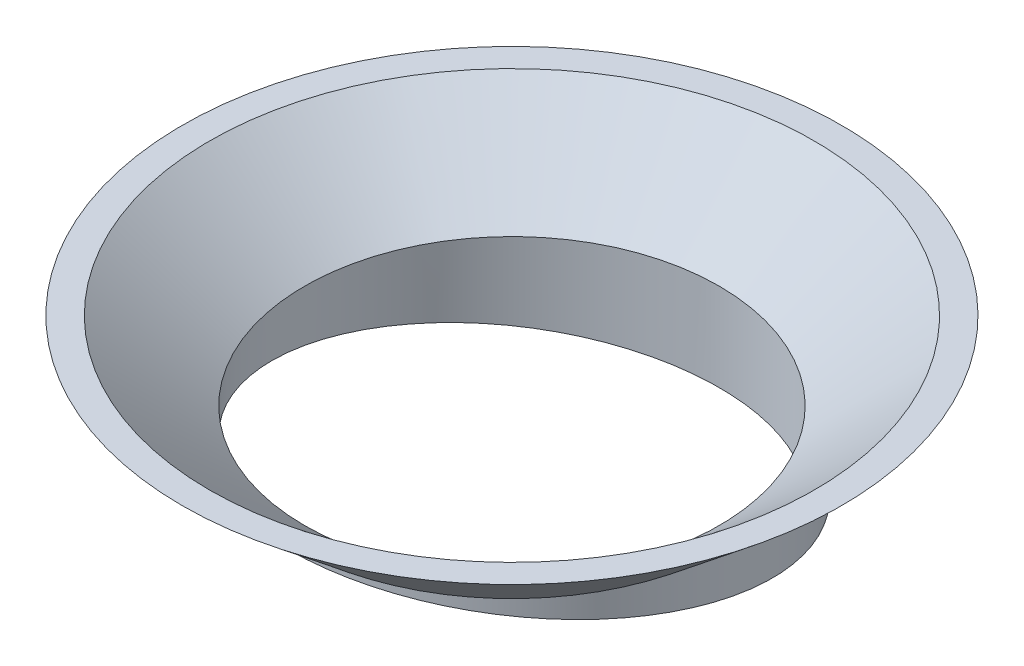
ISO-10303-21;
HEADER;
FILE_DESCRIPTION(('STEP AP214'),'2;1');
FILE_NAME('part.step','',(''),(''),'','','');
FILE_SCHEMA(('AUTOMOTIVE_DESIGN { 1 0 10303 214 1 1 1 1 }'));
ENDSEC;
DATA;
#1=APPLICATION_CONTEXT('core data for automotive mechanical design processes');
#2=APPLICATION_PROTOCOL_DEFINITION('international standard','automotive_design',2000,#1);
#3=PRODUCT_CONTEXT('',#1,'mechanical');
#4=PRODUCT('Part','Part','',(#3));
#5=PRODUCT_RELATED_PRODUCT_CATEGORY('part','',(#4));
#6=PRODUCT_DEFINITION_FORMATION('','',#4);
#7=PRODUCT_DEFINITION_CONTEXT('part definition',#1,'design');
#8=PRODUCT_DEFINITION('design','',#6,#7);
#9=PRODUCT_DEFINITION_SHAPE('','',#8);
#10=(LENGTH_UNIT() NAMED_UNIT(*) SI_UNIT(.MILLI.,.METRE.));
#11=(NAMED_UNIT(*) PLANE_ANGLE_UNIT() SI_UNIT($,.RADIAN.));
#12=(NAMED_UNIT(*) SI_UNIT($,.STERADIAN.) SOLID_ANGLE_UNIT());
#13=UNCERTAINTY_MEASURE_WITH_UNIT(LENGTH_MEASURE(1.E-05),#10,'distance_accuracy_value','');
#14=(GEOMETRIC_REPRESENTATION_CONTEXT(3) GLOBAL_UNCERTAINTY_ASSIGNED_CONTEXT((#13)) GLOBAL_UNIT_ASSIGNED_CONTEXT((#10,
#11,#12)) REPRESENTATION_CONTEXT('',''));
#15=CARTESIAN_POINT('',(0.,0.,0.));
#16=DIRECTION('',(0.,0.,1.));
#17=DIRECTION('',(1.,0.,0.));
#18=AXIS2_PLACEMENT_3D('',#15,#16,#17);
#19=CARTESIAN_POINT('',(0.,21.,0.));
#20=DIRECTION('',(0.,1.,0.));
#21=DIRECTION('',(0.,0.,1.));
#22=AXIS2_PLACEMENT_3D('',#19,#20,#21);
#23=CYLINDRICAL_SURFACE('',#22,26.);
#24=CARTESIAN_POINT('',(0.,5.,0.));
#25=DIRECTION('',(0.,0.984807753012208,-0.173648177666931));
#26=DIRECTION('',(0.,0.173648177666931,0.984807753012208));
#27=AXIS2_PLACEMENT_3D('',#24,#25,#26);
#28=ELLIPSE('',#27,26.4010919090294,26.);
#29=CARTESIAN_POINT('',(0.,9.5845014984201,26.));
#30=VERTEX_POINT('',#29);
#31=EDGE_CURVE('E50',#30,#30,#28,.T.);
#32=ORIENTED_EDGE('',*,*,#31,.T.);
#33=EDGE_LOOP('',(#32));
#34=FACE_BOUND('',#33,.T.);
#35=CARTESIAN_POINT('',(0.,10.,0.));
#36=DIRECTION('',(0.,1.,0.));
#37=DIRECTION('',(0.,0.,1.));
#38=AXIS2_PLACEMENT_3D('',#35,#36,#37);
#39=CIRCLE('',#38,26.);
#40=CARTESIAN_POINT('',(0.,10.,26.));
#41=VERTEX_POINT('',#40);
#42=EDGE_CURVE('E10',#41,#41,#39,.T.);
#43=ORIENTED_EDGE('',*,*,#42,.F.);
#44=EDGE_LOOP('',(#43));
#45=FACE_BOUND('',#44,.T.);
#46=ADVANCED_FACE('F31',(#34,#45),#23,.T.);
#47=CARTESIAN_POINT('',(0.,10.,0.));
#48=DIRECTION('',(0.,1.,0.));
#49=DIRECTION('',(0.,0.,1.));
#50=AXIS2_PLACEMENT_3D('',#47,#48,#49);
#51=CONICAL_SURFACE('',#50,26.,0.8820269953043);
#52=CARTESIAN_POINT('',(0.,20.,0.));
#53=DIRECTION('',(0.,1.,0.));
#54=DIRECTION('',(0.,0.,1.));
#55=AXIS2_PLACEMENT_3D('',#52,#53,#54);
#56=CIRCLE('',#55,38.1466947282605);
#57=CARTESIAN_POINT('',(0.,20.,38.1466947282605));
#58=VERTEX_POINT('',#57);
#59=EDGE_CURVE('E38',#58,#58,#56,.T.);
#60=ORIENTED_EDGE('',*,*,#59,.F.);
#61=EDGE_LOOP('',(#60));
#62=FACE_BOUND('',#61,.T.);
#63=ORIENTED_EDGE('',*,*,#42,.T.);
#64=EDGE_LOOP('',(#63));
#65=FACE_BOUND('',#64,.T.);
#66=ADVANCED_FACE('F71',(#62,#65),#51,.T.);
#67=CARTESIAN_POINT('',(38.1466947282605,20.,0.));
#68=DIRECTION('',(0.,-1.,0.));
#69=DIRECTION('',(0.,0.,-1.));
#70=AXIS2_PLACEMENT_3D('',#67,#68,#69);
#71=PLANE('',#70);
#72=CARTESIAN_POINT('',(0.,20.,0.));
#73=DIRECTION('',(0.,1.,0.));
#74=DIRECTION('',(0.,0.,1.));
#75=AXIS2_PLACEMENT_3D('',#72,#73,#74);
#76=CIRCLE('',#75,35.);
#77=CARTESIAN_POINT('',(0.,20.,35.));
#78=VERTEX_POINT('',#77);
#79=EDGE_CURVE('E42',#78,#78,#76,.T.);
#80=ORIENTED_EDGE('',*,*,#79,.F.);
#81=EDGE_LOOP('',(#80));
#82=FACE_BOUND('',#81,.T.);
#83=ORIENTED_EDGE('',*,*,#59,.T.);
#84=EDGE_LOOP('',(#83));
#85=FACE_BOUND('',#84,.T.);
#86=ADVANCED_FACE('F76',(#82,#85),#71,.F.);
#87=CARTESIAN_POINT('',(0.,20.,0.));
#88=DIRECTION('',(0.,1.,0.));
#89=DIRECTION('',(0.,0.,1.));
#90=AXIS2_PLACEMENT_3D('',#87,#88,#89);
#91=CONICAL_SURFACE('',#90,35.,0.8820269953043);
#92=CARTESIAN_POINT('',(0.,10.9440384844714,0.));
#93=DIRECTION('',(0.,1.,0.));
#94=DIRECTION('',(0.,0.,1.));
#95=AXIS2_PLACEMENT_3D('',#92,#93,#94);
#96=CIRCLE('',#95,24.);
#97=CARTESIAN_POINT('',(0.,10.9440384844714,24.));
#98=VERTEX_POINT('',#97);
#99=EDGE_CURVE('E47',#98,#98,#96,.T.);
#100=ORIENTED_EDGE('',*,*,#99,.F.);
#101=EDGE_LOOP('',(#100));
#102=FACE_BOUND('',#101,.T.);
#103=ORIENTED_EDGE('',*,*,#79,.T.);
#104=EDGE_LOOP('',(#103));
#105=FACE_BOUND('',#104,.T.);
#106=ADVANCED_FACE('F68',(#102,#105),#91,.F.);
#107=CARTESIAN_POINT('',(0.,21.,0.));
#108=DIRECTION('',(0.,1.,0.));
#109=DIRECTION('',(0.,0.,1.));
#110=AXIS2_PLACEMENT_3D('',#107,#108,#109);
#111=CYLINDRICAL_SURFACE('',#110,24.);
#112=CARTESIAN_POINT('',(0.,5.,0.));
#113=DIRECTION('',(0.,0.984807753012208,-0.173648177666931));
#114=DIRECTION('',(0.,0.173648177666931,0.984807753012208));
#115=AXIS2_PLACEMENT_3D('',#112,#113,#114);
#116=ELLIPSE('',#115,24.3702386852579,24.);
#117=CARTESIAN_POINT('',(0.,9.23184753700317,24.));
#118=VERTEX_POINT('',#117);
#119=EDGE_CURVE('E34',#118,#118,#116,.F.);
#120=ORIENTED_EDGE('',*,*,#119,.T.);
#121=EDGE_LOOP('',(#120));
#122=FACE_BOUND('',#121,.T.);
#123=ORIENTED_EDGE('',*,*,#99,.T.);
#124=EDGE_LOOP('',(#123));
#125=FACE_BOUND('',#124,.T.);
#126=ADVANCED_FACE('F57',(#122,#125),#111,.F.);
#127=CARTESIAN_POINT('',(0.,4.84923155196477,-0.855050358314174));
#128=DIRECTION('',(0.,0.984807753012208,-0.173648177666931));
#129=DIRECTION('',(0.,0.173648177666931,0.984807753012208));
#130=AXIS2_PLACEMENT_3D('',#127,#128,#129);
#131=PLANE('',#130);
#132=ORIENTED_EDGE('',*,*,#119,.F.);
#133=EDGE_LOOP('',(#132));
#134=FACE_BOUND('',#133,.T.);
#135=ORIENTED_EDGE('',*,*,#31,.F.);
#136=EDGE_LOOP('',(#135));
#137=FACE_BOUND('',#136,.T.);
#138=ADVANCED_FACE('F60',(#134,#137),#131,.F.);
#139=CLOSED_SHELL('',(#46,#66,#86,#106,#126,#138));
#140=MANIFOLD_SOLID_BREP('B2',#139);
#141=ADVANCED_BREP_SHAPE_REPRESENTATION('',(#18,#140),#14);
#142=SHAPE_DEFINITION_REPRESENTATION(#9,#141);
ENDSEC;
END-ISO-10303-21;
